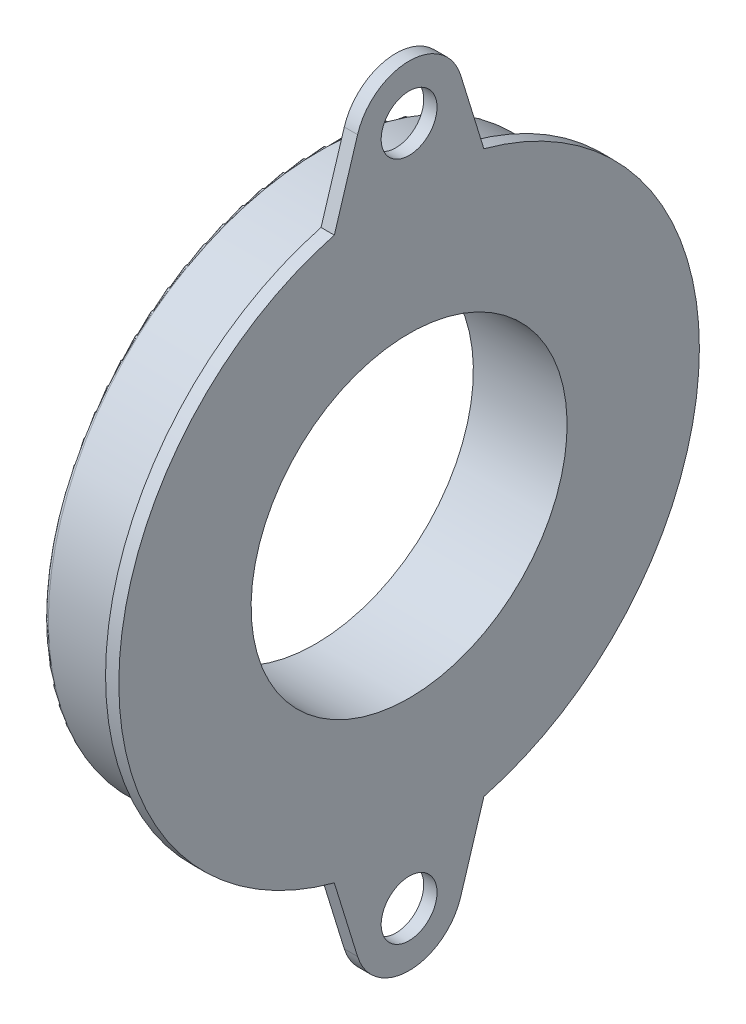
ISO-10303-21;
HEADER;
FILE_DESCRIPTION(('STEP AP214'),'2;1');
FILE_NAME('part.step','',(''),(''),'','','');
FILE_SCHEMA(('AUTOMOTIVE_DESIGN { 1 0 10303 214 1 1 1 1 }'));
ENDSEC;
DATA;
#1=APPLICATION_CONTEXT('core data for automotive mechanical design processes');
#2=APPLICATION_PROTOCOL_DEFINITION('international standard','automotive_design',2000,#1);
#3=PRODUCT_CONTEXT('',#1,'mechanical');
#4=PRODUCT('Part','Part','',(#3));
#5=PRODUCT_RELATED_PRODUCT_CATEGORY('part','',(#4));
#6=PRODUCT_DEFINITION_FORMATION('','',#4);
#7=PRODUCT_DEFINITION_CONTEXT('part definition',#1,'design');
#8=PRODUCT_DEFINITION('design','',#6,#7);
#9=PRODUCT_DEFINITION_SHAPE('','',#8);
#10=(LENGTH_UNIT() NAMED_UNIT(*) SI_UNIT(.MILLI.,.METRE.));
#11=(NAMED_UNIT(*) PLANE_ANGLE_UNIT() SI_UNIT($,.RADIAN.));
#12=(NAMED_UNIT(*) SI_UNIT($,.STERADIAN.) SOLID_ANGLE_UNIT());
#13=UNCERTAINTY_MEASURE_WITH_UNIT(LENGTH_MEASURE(1.E-05),#10,'distance_accuracy_value','');
#14=(GEOMETRIC_REPRESENTATION_CONTEXT(3) GLOBAL_UNCERTAINTY_ASSIGNED_CONTEXT((#13)) GLOBAL_UNIT_ASSIGNED_CONTEXT((#10,
#11,#12)) REPRESENTATION_CONTEXT('',''));
#15=CARTESIAN_POINT('',(0.,0.,0.));
#16=DIRECTION('',(0.,0.,1.));
#17=DIRECTION('',(1.,0.,0.));
#18=AXIS2_PLACEMENT_3D('',#15,#16,#17);
#19=CARTESIAN_POINT('',(-166.7002,-94.8054117549614,1701.53821105677));
#20=DIRECTION('',(0.,-0.294643766699233,0.955607163402037));
#21=DIRECTION('',(0.,-0.955607163402037,-0.294643766699233));
#22=AXIS2_PLACEMENT_3D('',#19,#20,#21);
#23=PLANE('',#22);
#24=DIRECTION('',(0.,-0.955607163402037,-0.294643766699233));
#25=VECTOR('',#24,1.);
#26=CARTESIAN_POINT('',(-165.1,-94.8054117549614,1701.53821105677));
#27=LINE('',#26,#25);
#28=CARTESIAN_POINT('',(-165.1,-33.8197828561924,1720.342));
#29=VERTEX_POINT('',#28);
#30=CARTESIAN_POINT('',(-165.1,-42.911491628585,1717.5387400193));
#31=VERTEX_POINT('',#30);
#32=EDGE_CURVE('E246',#29,#31,#27,.T.);
#33=ORIENTED_EDGE('',*,*,#32,.F.);
#34=DIRECTION('',(1.,0.,0.));
#35=VECTOR('',#34,1.);
#36=CARTESIAN_POINT('',(-166.7002,-33.8197828561924,1720.342));
#37=LINE('',#36,#35);
#38=CARTESIAN_POINT('',(-166.7002,-33.8197828561924,1720.342));
#39=VERTEX_POINT('',#38);
#40=EDGE_CURVE('E84',#39,#29,#37,.T.);
#41=ORIENTED_EDGE('',*,*,#40,.F.);
#42=DIRECTION('',(0.,-0.955607163402037,-0.294643766699233));
#43=VECTOR('',#42,1.);
#44=CARTESIAN_POINT('',(-166.7002,-94.8054117549614,1701.53821105677));
#45=LINE('',#44,#43);
#46=CARTESIAN_POINT('',(-166.7002,-42.911491628585,1717.5387400193));
#47=VERTEX_POINT('',#46);
#48=EDGE_CURVE('E254',#39,#47,#45,.T.);
#49=ORIENTED_EDGE('',*,*,#48,.T.);
#50=DIRECTION('',(1.,0.,0.));
#51=VECTOR('',#50,1.);
#52=CARTESIAN_POINT('',(-166.7002,-42.911491628585,1717.5387400193));
#53=LINE('',#52,#51);
#54=EDGE_CURVE('E37',#47,#31,#53,.T.);
#55=ORIENTED_EDGE('',*,*,#54,.T.);
#56=EDGE_LOOP('',(#33,#41,#49,#55));
#57=FACE_BOUND('',#56,.T.);
#58=ADVANCED_FACE('F14',(#57),#23,.T.);
#59=CARTESIAN_POINT('',(-166.7002,0.,1711.325));
#60=DIRECTION('',(1.,0.,0.));
#61=DIRECTION('',(0.,0.,-1.));
#62=AXIS2_PLACEMENT_3D('',#59,#60,#61);
#63=CYLINDRICAL_SURFACE('',#62,35.0012);
#64=CARTESIAN_POINT('',(-165.1,0.,1711.325));
#65=DIRECTION('',(-1.,0.,0.));
#66=DIRECTION('',(0.,-0.966246381729549,0.257619738751816));
#67=AXIS2_PLACEMENT_3D('',#64,#65,#66);
#68=CIRCLE('',#67,35.0012);
#69=CARTESIAN_POINT('',(-165.1,33.8197828561922,1720.342));
#70=VERTEX_POINT('',#69);
#71=EDGE_CURVE('E275',#29,#70,#68,.T.);
#72=ORIENTED_EDGE('',*,*,#71,.T.);
#73=DIRECTION('',(1.,0.,0.));
#74=VECTOR('',#73,1.);
#75=CARTESIAN_POINT('',(-166.7002,33.8197828561922,1720.342));
#76=LINE('',#75,#74);
#77=CARTESIAN_POINT('',(-166.7002,33.8197828561922,1720.342));
#78=VERTEX_POINT('',#77);
#79=EDGE_CURVE('E147',#78,#70,#76,.T.);
#80=ORIENTED_EDGE('',*,*,#79,.F.);
#81=CARTESIAN_POINT('',(-166.7002,0.,1711.325));
#82=DIRECTION('',(-1.,0.,0.));
#83=DIRECTION('',(0.,-0.966246381729549,0.257619738751816));
#84=AXIS2_PLACEMENT_3D('',#81,#82,#83);
#85=CIRCLE('',#84,35.0012);
#86=EDGE_CURVE('E258',#39,#78,#85,.T.);
#87=ORIENTED_EDGE('',*,*,#86,.F.);
#88=ORIENTED_EDGE('',*,*,#40,.T.);
#89=EDGE_LOOP('',(#72,#80,#87,#88));
#90=FACE_BOUND('',#89,.T.);
#91=ADVANCED_FACE('F184',(#90),#63,.T.);
#92=CARTESIAN_POINT('',(-166.7002,38.4856338406995,1718.90337128144));
#93=DIRECTION('',(0.,-0.294643766699233,-0.955607163402037));
#94=DIRECTION('',(0.,0.955607163402037,-0.294643766699233));
#95=AXIS2_PLACEMENT_3D('',#92,#93,#94);
#96=PLANE('',#95);
#97=DIRECTION('',(0.,0.955607163402037,-0.294643766699233));
#98=VECTOR('',#97,1.);
#99=CARTESIAN_POINT('',(-165.1,38.4856338406995,1718.90337128144));
#100=LINE('',#99,#98);
#101=CARTESIAN_POINT('',(-165.1,42.911491628585,1717.5387400193));
#102=VERTEX_POINT('',#101);
#103=EDGE_CURVE('E279',#70,#102,#100,.T.);
#104=ORIENTED_EDGE('',*,*,#103,.T.);
#105=DIRECTION('',(1.,0.,0.));
#106=VECTOR('',#105,1.);
#107=CARTESIAN_POINT('',(-166.7002,42.911491628585,1717.5387400193));
#108=LINE('',#107,#106);
#109=CARTESIAN_POINT('',(-166.7002,42.911491628585,1717.5387400193));
#110=VERTEX_POINT('',#109);
#111=EDGE_CURVE('E144',#110,#102,#108,.T.);
#112=ORIENTED_EDGE('',*,*,#111,.F.);
#113=DIRECTION('',(0.,0.955607163402037,-0.294643766699233));
#114=VECTOR('',#113,1.);
#115=CARTESIAN_POINT('',(-166.7002,38.4856338406995,1718.90337128144));
#116=LINE('',#115,#114);
#117=EDGE_CURVE('E262',#78,#110,#116,.T.);
#118=ORIENTED_EDGE('',*,*,#117,.F.);
#119=ORIENTED_EDGE('',*,*,#79,.T.);
#120=EDGE_LOOP('',(#104,#112,#118,#119));
#121=FACE_BOUND('',#120,.T.);
#122=ADVANCED_FACE('F188',(#121),#96,.F.);
#123=CARTESIAN_POINT('',(-166.7002,40.9956,1711.325));
#124=DIRECTION('',(1.,0.,0.));
#125=DIRECTION('',(0.,0.,-1.));
#126=AXIS2_PLACEMENT_3D('',#123,#124,#125);
#127=CYLINDRICAL_SURFACE('',#126,6.5024);
#128=CARTESIAN_POINT('',(-165.1,40.9956,1711.325));
#129=DIRECTION('',(-1.,0.,0.));
#130=DIRECTION('',(0.,0.294643766699231,0.955607163402038));
#131=AXIS2_PLACEMENT_3D('',#128,#129,#130);
#132=CIRCLE('',#131,6.5024);
#133=CARTESIAN_POINT('',(-165.1,42.911491628585,1705.11125998069));
#134=VERTEX_POINT('',#133);
#135=EDGE_CURVE('E283',#102,#134,#132,.T.);
#136=ORIENTED_EDGE('',*,*,#135,.T.);
#137=DIRECTION('',(1.,0.,0.));
#138=VECTOR('',#137,1.);
#139=CARTESIAN_POINT('',(-166.7002,42.911491628585,1705.11125998069));
#140=LINE('',#139,#138);
#141=CARTESIAN_POINT('',(-166.7002,42.911491628585,1705.11125998069));
#142=VERTEX_POINT('',#141);
#143=EDGE_CURVE('E136',#142,#134,#140,.T.);
#144=ORIENTED_EDGE('',*,*,#143,.F.);
#145=CARTESIAN_POINT('',(-166.7002,40.9956,1711.325));
#146=DIRECTION('',(-1.,0.,0.));
#147=DIRECTION('',(0.,0.294643766699231,0.955607163402038));
#148=AXIS2_PLACEMENT_3D('',#145,#146,#147);
#149=CIRCLE('',#148,6.5024);
#150=EDGE_CURVE('E266',#110,#142,#149,.T.);
#151=ORIENTED_EDGE('',*,*,#150,.F.);
#152=ORIENTED_EDGE('',*,*,#111,.T.);
#153=EDGE_LOOP('',(#136,#144,#151,#152));
#154=FACE_BOUND('',#153,.T.);
#155=ADVANCED_FACE('F194',(#154),#127,.T.);
#156=CARTESIAN_POINT('',(-166.7002,36.776257612061,1703.21957422379));
#157=DIRECTION('',(0.,0.29464376669919,-0.95560716340205));
#158=DIRECTION('',(0.,0.95560716340205,0.29464376669919));
#159=AXIS2_PLACEMENT_3D('',#156,#157,#158);
#160=PLANE('',#159);
#161=DIRECTION('',(0.,0.95560716340205,0.29464376669919));
#162=VECTOR('',#161,1.);
#163=CARTESIAN_POINT('',(-165.1,36.776257612061,1703.21957422379));
#164=LINE('',#163,#162);
#165=CARTESIAN_POINT('',(-165.1,33.8197828561923,1702.308));
#166=VERTEX_POINT('',#165);
#167=EDGE_CURVE('E287',#166,#134,#164,.T.);
#168=ORIENTED_EDGE('',*,*,#167,.F.);
#169=DIRECTION('',(1.,0.,0.));
#170=VECTOR('',#169,1.);
#171=CARTESIAN_POINT('',(-166.7002,33.8197828561923,1702.308));
#172=LINE('',#171,#170);
#173=CARTESIAN_POINT('',(-166.7002,33.8197828561923,1702.308));
#174=VERTEX_POINT('',#173);
#175=EDGE_CURVE('E131',#174,#166,#172,.T.);
#176=ORIENTED_EDGE('',*,*,#175,.F.);
#177=DIRECTION('',(0.,0.95560716340205,0.29464376669919));
#178=VECTOR('',#177,1.);
#179=CARTESIAN_POINT('',(-166.7002,36.776257612061,1703.21957422379));
#180=LINE('',#179,#178);
#181=EDGE_CURVE('E123',#174,#142,#180,.T.);
#182=ORIENTED_EDGE('',*,*,#181,.T.);
#183=ORIENTED_EDGE('',*,*,#143,.T.);
#184=EDGE_LOOP('',(#168,#176,#182,#183));
#185=FACE_BOUND('',#184,.T.);
#186=ADVANCED_FACE('F198',(#185),#160,.T.);
#187=CARTESIAN_POINT('',(-166.7002,0.,1711.325));
#188=DIRECTION('',(1.,0.,0.));
#189=DIRECTION('',(0.,0.,-1.));
#190=AXIS2_PLACEMENT_3D('',#187,#188,#189);
#191=CYLINDRICAL_SURFACE('',#190,35.0012);
#192=CARTESIAN_POINT('',(-165.1,0.,1711.325));
#193=DIRECTION('',(-1.,0.,0.));
#194=DIRECTION('',(0.,0.96624638172955,-0.257619738751815));
#195=AXIS2_PLACEMENT_3D('',#192,#193,#194);
#196=CIRCLE('',#195,35.0012);
#197=CARTESIAN_POINT('',(-165.1,-33.8197828561924,1702.308));
#198=VERTEX_POINT('',#197);
#199=EDGE_CURVE('E129',#166,#198,#196,.T.);
#200=ORIENTED_EDGE('',*,*,#199,.T.);
#201=DIRECTION('',(1.,0.,0.));
#202=VECTOR('',#201,1.);
#203=CARTESIAN_POINT('',(-166.7002,-33.8197828561924,1702.308));
#204=LINE('',#203,#202);
#205=CARTESIAN_POINT('',(-166.7002,-33.8197828561924,1702.308));
#206=VERTEX_POINT('',#205);
#207=EDGE_CURVE('E110',#206,#198,#204,.T.);
#208=ORIENTED_EDGE('',*,*,#207,.F.);
#209=CARTESIAN_POINT('',(-166.7002,0.,1711.325));
#210=DIRECTION('',(-1.,0.,0.));
#211=DIRECTION('',(0.,0.96624638172955,-0.257619738751815));
#212=AXIS2_PLACEMENT_3D('',#209,#210,#211);
#213=CIRCLE('',#212,35.0012);
#214=EDGE_CURVE('E116',#174,#206,#213,.T.);
#215=ORIENTED_EDGE('',*,*,#214,.F.);
#216=ORIENTED_EDGE('',*,*,#175,.T.);
#217=EDGE_LOOP('',(#200,#208,#215,#216));
#218=FACE_BOUND('',#217,.T.);
#219=ADVANCED_FACE('F127',(#218),#191,.T.);
#220=CARTESIAN_POINT('',(-166.7002,19.5435203021932,1685.85441399911));
#221=DIRECTION('',(0.,0.29464376669919,0.95560716340205));
#222=DIRECTION('',(0.,-0.95560716340205,0.29464376669919));
#223=AXIS2_PLACEMENT_3D('',#220,#221,#222);
#224=PLANE('',#223);
#225=DIRECTION('',(0.,-0.95560716340205,0.29464376669919));
#226=VECTOR('',#225,1.);
#227=CARTESIAN_POINT('',(-165.1,19.5435203021932,1685.85441399911));
#228=LINE('',#227,#226);
#229=CARTESIAN_POINT('',(-165.1,-42.911491628585,1705.11125998069));
#230=VERTEX_POINT('',#229);
#231=EDGE_CURVE('E293',#198,#230,#228,.T.);
#232=ORIENTED_EDGE('',*,*,#231,.T.);
#233=DIRECTION('',(1.,0.,0.));
#234=VECTOR('',#233,1.);
#235=CARTESIAN_POINT('',(-166.7002,-42.911491628585,1705.11125998069));
#236=LINE('',#235,#234);
#237=CARTESIAN_POINT('',(-166.7002,-42.911491628585,1705.11125998069));
#238=VERTEX_POINT('',#237);
#239=EDGE_CURVE('E72',#238,#230,#236,.T.);
#240=ORIENTED_EDGE('',*,*,#239,.F.);
#241=DIRECTION('',(0.,-0.95560716340205,0.29464376669919));
#242=VECTOR('',#241,1.);
#243=CARTESIAN_POINT('',(-166.7002,19.5435203021932,1685.85441399911));
#244=LINE('',#243,#242);
#245=EDGE_CURVE('E106',#206,#238,#244,.T.);
#246=ORIENTED_EDGE('',*,*,#245,.F.);
#247=ORIENTED_EDGE('',*,*,#207,.T.);
#248=EDGE_LOOP('',(#232,#240,#246,#247));
#249=FACE_BOUND('',#248,.T.);
#250=ADVANCED_FACE('F108',(#249),#224,.F.);
#251=CARTESIAN_POINT('',(-166.7002,-40.9956,1711.325));
#252=DIRECTION('',(1.,0.,0.));
#253=DIRECTION('',(0.,0.,-1.));
#254=AXIS2_PLACEMENT_3D('',#251,#252,#253);
#255=CYLINDRICAL_SURFACE('',#254,6.5024);
#256=CARTESIAN_POINT('',(-165.1,-40.9956,1711.325));
#257=DIRECTION('',(1.,0.,0.));
#258=DIRECTION('',(0.,-0.294643766699231,0.955607163402038));
#259=AXIS2_PLACEMENT_3D('',#256,#257,#258);
#260=CIRCLE('',#259,6.5024);
#261=EDGE_CURVE('E255',#31,#230,#260,.T.);
#262=ORIENTED_EDGE('',*,*,#261,.F.);
#263=ORIENTED_EDGE('',*,*,#54,.F.);
#264=CARTESIAN_POINT('',(-166.7002,-40.9956,1711.325));
#265=DIRECTION('',(1.,0.,0.));
#266=DIRECTION('',(0.,-0.294643766699231,0.955607163402038));
#267=AXIS2_PLACEMENT_3D('',#264,#265,#266);
#268=CIRCLE('',#267,6.5024);
#269=EDGE_CURVE('E115',#47,#238,#268,.T.);
#270=ORIENTED_EDGE('',*,*,#269,.T.);
#271=ORIENTED_EDGE('',*,*,#239,.T.);
#272=EDGE_LOOP('',(#262,#263,#270,#271));
#273=FACE_BOUND('',#272,.T.);
#274=ADVANCED_FACE('F207',(#273),#255,.T.);
#275=CARTESIAN_POINT('',(-166.7002,0.,1711.325));
#276=DIRECTION('',(-1.,0.,0.));
#277=DIRECTION('',(0.,-1.,0.));
#278=AXIS2_PLACEMENT_3D('',#275,#276,#277);
#279=PLANE('',#278);
#280=CARTESIAN_POINT('',(-166.7002,-40.9956,1711.325));
#281=DIRECTION('',(-1.,0.,0.));
#282=DIRECTION('',(0.,0.,1.));
#283=AXIS2_PLACEMENT_3D('',#280,#281,#282);
#284=CIRCLE('',#283,3.36549999999991);
#285=CARTESIAN_POINT('',(-166.7002,-40.9956,1714.6905));
#286=VERTEX_POINT('',#285);
#287=EDGE_CURVE('E159',#286,#286,#284,.F.);
#288=ORIENTED_EDGE('',*,*,#287,.T.);
#289=EDGE_LOOP('',(#288));
#290=FACE_BOUND('',#289,.T.);
#291=CARTESIAN_POINT('',(-166.7002,40.9956,1711.325));
#292=DIRECTION('',(-1.,0.,0.));
#293=DIRECTION('',(0.,0.,1.));
#294=AXIS2_PLACEMENT_3D('',#291,#292,#293);
#295=CIRCLE('',#294,3.36549999999991);
#296=CARTESIAN_POINT('',(-166.7002,40.9956,1714.6905));
#297=VERTEX_POINT('',#296);
#298=EDGE_CURVE('E153',#297,#297,#295,.F.);
#299=ORIENTED_EDGE('',*,*,#298,.T.);
#300=EDGE_LOOP('',(#299));
#301=FACE_BOUND('',#300,.T.);
#302=CARTESIAN_POINT('',(-166.7002,0.,1711.325));
#303=DIRECTION('',(-1.,0.,0.));
#304=DIRECTION('',(0.,-1.,0.));
#305=AXIS2_PLACEMENT_3D('',#302,#303,#304);
#306=CIRCLE('',#305,32.7025);
#307=CARTESIAN_POINT('',(-166.7002,-32.7025000000001,1711.325));
#308=VERTEX_POINT('',#307);
#309=EDGE_CURVE('E250',#308,#308,#306,.T.);
#310=ORIENTED_EDGE('',*,*,#309,.F.);
#311=EDGE_LOOP('',(#310));
#312=FACE_BOUND('',#311,.T.);
#313=ORIENTED_EDGE('',*,*,#48,.F.);
#314=ORIENTED_EDGE('',*,*,#86,.T.);
#315=ORIENTED_EDGE('',*,*,#117,.T.);
#316=ORIENTED_EDGE('',*,*,#150,.T.);
#317=ORIENTED_EDGE('',*,*,#181,.F.);
#318=ORIENTED_EDGE('',*,*,#214,.T.);
#319=ORIENTED_EDGE('',*,*,#245,.T.);
#320=ORIENTED_EDGE('',*,*,#269,.F.);
#321=EDGE_LOOP('',(#313,#314,#315,#316,#317,#318,#319,#320));
#322=FACE_BOUND('',#321,.T.);
#323=ADVANCED_FACE('F121',(#290,#301,#312,#322),#279,.T.);
#324=CARTESIAN_POINT('',(-165.1,0.,1711.325));
#325=DIRECTION('',(-1.,0.,0.));
#326=DIRECTION('',(0.,-1.,0.));
#327=AXIS2_PLACEMENT_3D('',#324,#325,#326);
#328=PLANE('',#327);
#329=CARTESIAN_POINT('',(-165.1,-40.9956,1711.325));
#330=DIRECTION('',(1.,0.,0.));
#331=DIRECTION('',(0.,0.,-1.));
#332=AXIS2_PLACEMENT_3D('',#329,#330,#331);
#333=CIRCLE('',#332,3.36549999999991);
#334=CARTESIAN_POINT('',(-165.1,-40.9956,1707.9595));
#335=VERTEX_POINT('',#334);
#336=EDGE_CURVE('E162',#335,#335,#333,.T.);
#337=ORIENTED_EDGE('',*,*,#336,.F.);
#338=EDGE_LOOP('',(#337));
#339=FACE_BOUND('',#338,.T.);
#340=CARTESIAN_POINT('',(-165.1,40.9956,1711.325));
#341=DIRECTION('',(1.,0.,0.));
#342=DIRECTION('',(0.,0.,-1.));
#343=AXIS2_PLACEMENT_3D('',#340,#341,#342);
#344=CIRCLE('',#343,3.36549999999991);
#345=CARTESIAN_POINT('',(-165.1,40.9956,1707.9595));
#346=VERTEX_POINT('',#345);
#347=EDGE_CURVE('E158',#346,#346,#344,.T.);
#348=ORIENTED_EDGE('',*,*,#347,.F.);
#349=EDGE_LOOP('',(#348));
#350=FACE_BOUND('',#349,.T.);
#351=ORIENTED_EDGE('',*,*,#32,.T.);
#352=ORIENTED_EDGE('',*,*,#261,.T.);
#353=ORIENTED_EDGE('',*,*,#231,.F.);
#354=ORIENTED_EDGE('',*,*,#199,.F.);
#355=ORIENTED_EDGE('',*,*,#167,.T.);
#356=ORIENTED_EDGE('',*,*,#135,.F.);
#357=ORIENTED_EDGE('',*,*,#103,.F.);
#358=ORIENTED_EDGE('',*,*,#71,.F.);
#359=EDGE_LOOP('',(#351,#352,#353,#354,#355,#356,#357,#358));
#360=FACE_BOUND('',#359,.T.);
#361=CARTESIAN_POINT('',(-165.1,0.,1711.325));
#362=DIRECTION('',(-1.,0.,0.));
#363=DIRECTION('',(0.,-1.,0.));
#364=AXIS2_PLACEMENT_3D('',#361,#362,#363);
#365=CIRCLE('',#364,19.05);
#366=CARTESIAN_POINT('',(-165.1,-19.0500000000001,1711.325));
#367=VERTEX_POINT('',#366);
#368=EDGE_CURVE('E157',#367,#367,#365,.T.);
#369=ORIENTED_EDGE('',*,*,#368,.T.);
#370=EDGE_LOOP('',(#369));
#371=FACE_BOUND('',#370,.T.);
#372=ADVANCED_FACE('F210',(#339,#350,#360,#371),#328,.F.);
#373=CARTESIAN_POINT('',(-176.403,0.,1711.325));
#374=DIRECTION('',(1.,0.,0.));
#375=DIRECTION('',(0.,0.,-1.));
#376=AXIS2_PLACEMENT_3D('',#373,#374,#375);
#377=CYLINDRICAL_SURFACE('',#376,32.7025);
#378=CARTESIAN_POINT('',(-175.895,0.,1711.325));
#379=DIRECTION('',(-1.,0.,0.));
#380=DIRECTION('',(0.,0.,1.));
#381=AXIS2_PLACEMENT_3D('',#378,#379,#380);
#382=CIRCLE('',#381,32.7025);
#383=CARTESIAN_POINT('',(-175.895,0.,1744.0275));
#384=VERTEX_POINT('',#383);
#385=EDGE_CURVE('E9',#384,#384,#382,.F.);
#386=ORIENTED_EDGE('',*,*,#385,.T.);
#387=EDGE_LOOP('',(#386));
#388=FACE_BOUND('',#387,.T.);
#389=ORIENTED_EDGE('',*,*,#309,.T.);
#390=EDGE_LOOP('',(#389));
#391=FACE_BOUND('',#390,.T.);
#392=ADVANCED_FACE('F213',(#388,#391),#377,.T.);
#393=CARTESIAN_POINT('',(-176.403,0.,1711.325));
#394=DIRECTION('',(1.,0.,0.));
#395=DIRECTION('',(0.,0.,-1.));
#396=AXIS2_PLACEMENT_3D('',#393,#394,#395);
#397=CYLINDRICAL_SURFACE('',#396,19.05);
#398=CARTESIAN_POINT('',(-176.403,0.,1711.325));
#399=DIRECTION('',(-1.,0.,0.));
#400=DIRECTION('',(0.,-1.,0.));
#401=AXIS2_PLACEMENT_3D('',#398,#399,#400);
#402=CIRCLE('',#401,19.05);
#403=CARTESIAN_POINT('',(-176.403,-19.0500000000001,1711.325));
#404=VERTEX_POINT('',#403);
#405=EDGE_CURVE('E242',#404,#404,#402,.T.);
#406=ORIENTED_EDGE('',*,*,#405,.T.);
#407=EDGE_LOOP('',(#406));
#408=FACE_BOUND('',#407,.T.);
#409=ORIENTED_EDGE('',*,*,#368,.F.);
#410=EDGE_LOOP('',(#409));
#411=FACE_BOUND('',#410,.T.);
#412=ADVANCED_FACE('F218',(#408,#411),#397,.F.);
#413=CARTESIAN_POINT('',(-176.403,0.,1711.325));
#414=DIRECTION('',(-1.,0.,0.));
#415=DIRECTION('',(0.,-1.,0.));
#416=AXIS2_PLACEMENT_3D('',#413,#414,#415);
#417=PLANE('',#416);
#418=CARTESIAN_POINT('',(-176.403,0.,1711.325));
#419=DIRECTION('',(-1.,0.,0.));
#420=DIRECTION('',(0.,0.,1.));
#421=AXIS2_PLACEMENT_3D('',#418,#419,#420);
#422=CIRCLE('',#421,32.1945);
#423=CARTESIAN_POINT('',(-176.403,0.,1743.5195));
#424=VERTEX_POINT('',#423);
#425=EDGE_CURVE('E24',#424,#424,#422,.T.);
#426=ORIENTED_EDGE('',*,*,#425,.T.);
#427=EDGE_LOOP('',(#426));
#428=FACE_BOUND('',#427,.T.);
#429=ORIENTED_EDGE('',*,*,#405,.F.);
#430=EDGE_LOOP('',(#429));
#431=FACE_BOUND('',#430,.T.);
#432=ADVANCED_FACE('F169',(#428,#431),#417,.T.);
#433=CARTESIAN_POINT('',(-284.653638380059,40.9956,1711.325));
#434=DIRECTION('',(1.,0.,0.));
#435=DIRECTION('',(0.,0.,-1.));
#436=AXIS2_PLACEMENT_3D('',#433,#434,#435);
#437=CYLINDRICAL_SURFACE('',#436,3.36549999999991);
#438=ORIENTED_EDGE('',*,*,#298,.F.);
#439=EDGE_LOOP('',(#438));
#440=FACE_BOUND('',#439,.T.);
#441=ORIENTED_EDGE('',*,*,#347,.T.);
#442=EDGE_LOOP('',(#441));
#443=FACE_BOUND('',#442,.T.);
#444=ADVANCED_FACE('F179',(#440,#443),#437,.F.);
#445=CARTESIAN_POINT('',(-284.653638380059,-40.9956,1711.325));
#446=DIRECTION('',(1.,0.,0.));
#447=DIRECTION('',(0.,0.,-1.));
#448=AXIS2_PLACEMENT_3D('',#445,#446,#447);
#449=CYLINDRICAL_SURFACE('',#448,3.36549999999991);
#450=ORIENTED_EDGE('',*,*,#287,.F.);
#451=EDGE_LOOP('',(#450));
#452=FACE_BOUND('',#451,.T.);
#453=ORIENTED_EDGE('',*,*,#336,.T.);
#454=EDGE_LOOP('',(#453));
#455=FACE_BOUND('',#454,.T.);
#456=ADVANCED_FACE('F173',(#452,#455),#449,.F.);
#457=CARTESIAN_POINT('',(-175.895,0.,1711.325));
#458=DIRECTION('',(-1.,0.,0.));
#459=DIRECTION('',(0.,0.,1.));
#460=AXIS2_PLACEMENT_3D('',#457,#458,#459);
#461=TOROIDAL_SURFACE('',#460,32.1945,0.508);
#462=ORIENTED_EDGE('',*,*,#385,.F.);
#463=EDGE_LOOP('',(#462));
#464=FACE_BOUND('',#463,.T.);
#465=ORIENTED_EDGE('',*,*,#425,.F.);
#466=EDGE_LOOP('',(#465));
#467=FACE_BOUND('',#466,.T.);
#468=ADVANCED_FACE('F16',(#464,#467),#461,.T.);
#469=CLOSED_SHELL('',(#58,#91,#122,#155,#186,#219,#250,#274,#323,#372,#392,#412,#432,#444,#456,#468));
#470=MANIFOLD_SOLID_BREP('B1',#469);
#471=ADVANCED_BREP_SHAPE_REPRESENTATION('',(#18,#470),#14);
#472=SHAPE_DEFINITION_REPRESENTATION(#9,#471);
ENDSEC;
END-ISO-10303-21;
